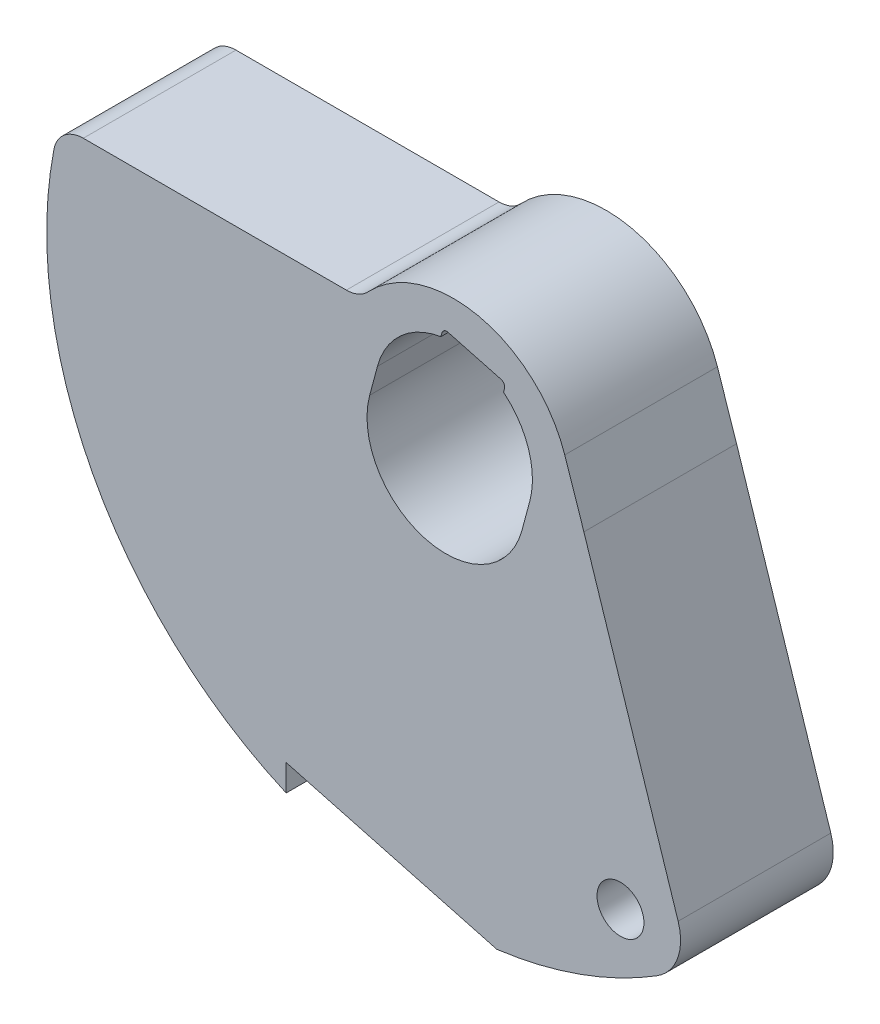
ISO-10303-21;
HEADER;
FILE_DESCRIPTION(('STEP AP214'),'2;1');
FILE_NAME('part.step','',(''),(''),'','','');
FILE_SCHEMA(('AUTOMOTIVE_DESIGN { 1 0 10303 214 1 1 1 1 }'));
ENDSEC;
DATA;
#1=APPLICATION_CONTEXT('core data for automotive mechanical design processes');
#2=APPLICATION_PROTOCOL_DEFINITION('international standard','automotive_design',2000,#1);
#3=PRODUCT_CONTEXT('',#1,'mechanical');
#4=PRODUCT('Part','Part','',(#3));
#5=PRODUCT_RELATED_PRODUCT_CATEGORY('part','',(#4));
#6=PRODUCT_DEFINITION_FORMATION('','',#4);
#7=PRODUCT_DEFINITION_CONTEXT('part definition',#1,'design');
#8=PRODUCT_DEFINITION('design','',#6,#7);
#9=PRODUCT_DEFINITION_SHAPE('','',#8);
#10=(LENGTH_UNIT() NAMED_UNIT(*) SI_UNIT(.MILLI.,.METRE.));
#11=(NAMED_UNIT(*) PLANE_ANGLE_UNIT() SI_UNIT($,.RADIAN.));
#12=(NAMED_UNIT(*) SI_UNIT($,.STERADIAN.) SOLID_ANGLE_UNIT());
#13=UNCERTAINTY_MEASURE_WITH_UNIT(LENGTH_MEASURE(1.E-05),#10,'distance_accuracy_value','');
#14=(GEOMETRIC_REPRESENTATION_CONTEXT(3) GLOBAL_UNCERTAINTY_ASSIGNED_CONTEXT((#13)) GLOBAL_UNIT_ASSIGNED_CONTEXT((#10,
#11,#12)) REPRESENTATION_CONTEXT('',''));
#15=CARTESIAN_POINT('',(0.,0.,0.));
#16=DIRECTION('',(0.,0.,1.));
#17=DIRECTION('',(1.,0.,0.));
#18=AXIS2_PLACEMENT_3D('',#15,#16,#17);
#19=CARTESIAN_POINT('',(0.,0.,-7.7724));
#20=DIRECTION('',(0.,0.,1.));
#21=DIRECTION('',(1.,0.,0.));
#22=AXIS2_PLACEMENT_3D('',#19,#20,#21);
#23=PLANE('',#22);
#24=DIRECTION('',(0.258819045102514,0.96592582628907,0.));
#25=VECTOR('',#24,1.);
#26=CARTESIAN_POINT('',(-1.59474353920326,0.427310243464251,-7.7724));
#27=LINE('',#26,#25);
#28=CARTESIAN_POINT('',(-0.253578298371034,5.43260706359561,-7.7724));
#29=VERTEX_POINT('',#28);
#30=CARTESIAN_POINT('',(-0.201054745135242,5.62862763286563,-7.7724));
#31=VERTEX_POINT('',#30);
#32=EDGE_CURVE('E330',#29,#31,#27,.T.);
#33=ORIENTED_EDGE('',*,*,#32,.F.);
#34=CARTESIAN_POINT('',(0.394440224736231,1.47207095926454,-7.7724));
#35=DIRECTION('',(0.,0.,1.));
#36=DIRECTION('',(1.,0.,0.));
#37=AXIS2_PLACEMENT_3D('',#34,#35,#36);
#38=CIRCLE('',#37,4.0132);
#39=CARTESIAN_POINT('',(-3.48201330132707,2.51076355106995,-7.7724));
#40=VERTEX_POINT('',#39);
#41=EDGE_CURVE('E221',#29,#40,#38,.T.);
#42=ORIENTED_EDGE('',*,*,#41,.T.);
#43=DIRECTION('',(0.258819045102514,0.96592582628907,0.));
#44=VECTOR('',#43,1.);
#45=CARTESIAN_POINT('',(-3.8764535260633,1.03869259180541,-7.7724));
#46=LINE('',#45,#44);
#47=CARTESIAN_POINT('',(-3.8764535260633,1.03869259180541,-7.7724));
#48=VERTEX_POINT('',#47);
#49=EDGE_CURVE('E351',#48,#40,#46,.T.);
#50=ORIENTED_EDGE('',*,*,#49,.F.);
#51=CARTESIAN_POINT('',(0.,0.,-7.7724));
#52=DIRECTION('',(0.,0.,1.));
#53=DIRECTION('',(1.,0.,0.));
#54=AXIS2_PLACEMENT_3D('',#51,#52,#53);
#55=CIRCLE('',#54,4.0132);
#56=CARTESIAN_POINT('',(3.8764535260633,-1.03869259180541,-7.7724));
#57=VERTEX_POINT('',#56);
#58=EDGE_CURVE('E349',#48,#57,#55,.T.);
#59=ORIENTED_EDGE('',*,*,#58,.T.);
#60=DIRECTION('',(-0.258819045102514,-0.96592582628907,0.));
#61=VECTOR('',#60,1.);
#62=CARTESIAN_POINT('',(3.8764535260633,-1.03869259180541,-7.7724));
#63=LINE('',#62,#61);
#64=CARTESIAN_POINT('',(4.27089375079953,0.433378367459132,-7.7724));
#65=VERTEX_POINT('',#64);
#66=EDGE_CURVE('E346',#65,#57,#63,.T.);
#67=ORIENTED_EDGE('',*,*,#66,.F.);
#68=CARTESIAN_POINT('',(0.394440224736231,1.47207095926454,-7.7724));
#69=DIRECTION('',(0.,0.,1.));
#70=DIRECTION('',(1.,0.,0.));
#71=AXIS2_PLACEMENT_3D('',#68,#69,#70);
#72=CIRCLE('',#71,4.0132);
#73=CARTESIAN_POINT('',(2.93590878003548,4.5779865766671,-7.7724));
#74=VERTEX_POINT('',#73);
#75=EDGE_CURVE('E343',#65,#74,#72,.T.);
#76=ORIENTED_EDGE('',*,*,#75,.T.);
#77=DIRECTION('',(0.258819045102513,0.96592582628907,0.));
#78=VECTOR('',#77,1.);
#79=CARTESIAN_POINT('',(1.59474353920326,-0.427310243464251,-7.7724));
#80=LINE('',#79,#78);
#81=CARTESIAN_POINT('',(2.98843233327127,4.77400714593713,-7.7724));
#82=VERTEX_POINT('',#81);
#83=EDGE_CURVE('E341',#74,#82,#80,.T.);
#84=ORIENTED_EDGE('',*,*,#83,.T.);
#85=CARTESIAN_POINT('',(2.74308717339385,4.83974718339317,-7.7724));
#86=DIRECTION('',(0.,0.,1.));
#87=DIRECTION('',(1.,0.,0.));
#88=AXIS2_PLACEMENT_3D('',#85,#86,#87);
#89=CIRCLE('',#88,0.254);
#90=CARTESIAN_POINT('',(2.80882721084989,5.0850923432706,-7.7724));
#91=VERTEX_POINT('',#90);
#92=EDGE_CURVE('E338',#91,#82,#89,.F.);
#93=ORIENTED_EDGE('',*,*,#92,.F.);
#94=DIRECTION('',(-0.96592582628907,0.258819045102514,0.));
#95=VECTOR('',#94,1.);
#96=CARTESIAN_POINT('',(1.45942883152406,5.44666254927881,-7.7724));
#97=LINE('',#96,#95);
#98=CARTESIAN_POINT('',(0.110030452198222,5.80823275528702,-7.7724));
#99=VERTEX_POINT('',#98);
#100=EDGE_CURVE('E336',#91,#99,#97,.T.);
#101=ORIENTED_EDGE('',*,*,#100,.T.);
#102=CARTESIAN_POINT('',(0.044290414742182,5.5628875954096,-7.7724));
#103=DIRECTION('',(0.,0.,1.));
#104=DIRECTION('',(1.,0.,0.));
#105=AXIS2_PLACEMENT_3D('',#102,#103,#104);
#106=CIRCLE('',#105,0.254);
#107=EDGE_CURVE('E333',#31,#99,#106,.F.);
#108=ORIENTED_EDGE('',*,*,#107,.F.);
#109=EDGE_LOOP('',(#33,#42,#50,#59,#67,#76,#84,#93,#101,#108));
#110=FACE_BOUND('',#109,.T.);
#111=CARTESIAN_POINT('',(8.89000000000001,-15.24,-7.7724));
#112=DIRECTION('',(0.,0.,1.));
#113=DIRECTION('',(1.,0.,0.));
#114=AXIS2_PLACEMENT_3D('',#111,#112,#113);
#115=CIRCLE('',#114,1.1938);
#116=CARTESIAN_POINT('',(10.0838,-15.24,-7.7724));
#117=VERTEX_POINT('',#116);
#118=EDGE_CURVE('E327',#117,#117,#115,.T.);
#119=ORIENTED_EDGE('',*,*,#118,.T.);
#120=EDGE_LOOP('',(#119));
#121=FACE_BOUND('',#120,.T.);
#122=DIRECTION('',(-0.309016994374945,0.951056516295155,0.));
#123=VECTOR('',#122,1.);
#124=CARTESIAN_POINT('',(6.4943201526941,2.11013253125259,-7.7724));
#125=LINE('',#124,#123);
#126=CARTESIAN_POINT('',(11.8264250960001,-14.3003990712514,-7.7724));
#127=VERTEX_POINT('',#126);
#128=CARTESIAN_POINT('',(7.02813733386458,0.467212180902899,-7.7724));
#129=VERTEX_POINT('',#128);
#130=EDGE_CURVE('E181',#127,#129,#125,.T.);
#131=ORIENTED_EDGE('',*,*,#130,.F.);
#132=CARTESIAN_POINT('',(9.41074154461045,-15.0853022369637,-7.7724));
#133=DIRECTION('',(0.,0.,1.));
#134=DIRECTION('',(1.,0.,0.));
#135=AXIS2_PLACEMENT_3D('',#132,#133,#134);
#136=CIRCLE('',#135,2.54);
#137=CARTESIAN_POINT('',(10.7551331938405,-17.2403454136728,-7.7724));
#138=VERTEX_POINT('',#137);
#139=EDGE_CURVE('E60',#127,#138,#136,.F.);
#140=ORIENTED_EDGE('',*,*,#139,.T.);
#141=CARTESIAN_POINT('',(0.,0.,-7.7724));
#142=DIRECTION('',(0.,0.,1.));
#143=DIRECTION('',(1.,0.,0.));
#144=AXIS2_PLACEMENT_3D('',#141,#142,#143);
#145=CIRCLE('',#144,20.32);
#146=CARTESIAN_POINT('',(2.59308441542165,-20.1538659620058,-7.7724));
#147=VERTEX_POINT('',#146);
#148=EDGE_CURVE('E198',#147,#138,#145,.T.);
#149=ORIENTED_EDGE('',*,*,#148,.F.);
#150=DIRECTION('',(0.96592582628907,-0.258819045102515,0.));
#151=VECTOR('',#150,1.);
#152=CARTESIAN_POINT('',(-4.86476277174687,-18.1555418309294,-7.7724));
#153=LINE('',#152,#151);
#154=CARTESIAN_POINT('',(-8.12799999999999,-17.2811600509078,-7.7724));
#155=VERTEX_POINT('',#154);
#156=EDGE_CURVE('E322',#155,#147,#153,.T.);
#157=ORIENTED_EDGE('',*,*,#156,.F.);
#158=DIRECTION('',(0.,-1.,0.));
#159=VECTOR('',#158,1.);
#160=CARTESIAN_POINT('',(-8.12799999999999,0.,-7.7724));
#161=LINE('',#160,#159);
#162=CARTESIAN_POINT('',(-8.12799999999999,-18.6235876243005,-7.7724));
#163=VERTEX_POINT('',#162);
#164=EDGE_CURVE('E320',#155,#163,#161,.T.);
#165=ORIENTED_EDGE('',*,*,#164,.T.);
#166=CARTESIAN_POINT('',(0.,0.,-7.7724));
#167=DIRECTION('',(0.,0.,1.));
#168=DIRECTION('',(1.,0.,0.));
#169=AXIS2_PLACEMENT_3D('',#166,#167,#168);
#170=CIRCLE('',#169,20.32);
#171=CARTESIAN_POINT('',(-19.953034117382,3.84432432432431,-7.7724));
#172=VERTEX_POINT('',#171);
#173=EDGE_CURVE('E317',#172,#163,#170,.T.);
#174=ORIENTED_EDGE('',*,*,#173,.F.);
#175=CARTESIAN_POINT('',(-18.4565565585783,3.55599999999999,-7.7724));
#176=DIRECTION('',(0.,0.,1.));
#177=DIRECTION('',(1.,0.,0.));
#178=AXIS2_PLACEMENT_3D('',#175,#176,#177);
#179=CIRCLE('',#178,1.524);
#180=CARTESIAN_POINT('',(-18.4565565585783,5.07999999999999,-7.7724));
#181=VERTEX_POINT('',#180);
#182=EDGE_CURVE('E312',#181,#172,#179,.T.);
#183=ORIENTED_EDGE('',*,*,#182,.F.);
#184=DIRECTION('',(-1.,0.,0.));
#185=VECTOR('',#184,1.);
#186=CARTESIAN_POINT('',(0.,5.07999999999999,-7.7724));
#187=LINE('',#186,#185);
#188=CARTESIAN_POINT('',(-5.06526245222852,5.07999999999999,-7.7724));
#189=VERTEX_POINT('',#188);
#190=EDGE_CURVE('E308',#189,#181,#187,.T.);
#191=ORIENTED_EDGE('',*,*,#190,.F.);
#192=CARTESIAN_POINT('',(-5.06526245222852,6.60399999999999,-7.7724));
#193=DIRECTION('',(0.,0.,1.));
#194=DIRECTION('',(1.,0.,0.));
#195=AXIS2_PLACEMENT_3D('',#192,#193,#194);
#196=CIRCLE('',#195,1.524);
#197=CARTESIAN_POINT('',(-3.954814450134,5.56021782222329,-7.7724));
#198=VERTEX_POINT('',#197);
#199=EDGE_CURVE('E306',#189,#198,#196,.T.);
#200=ORIENTED_EDGE('',*,*,#199,.T.);
#201=CARTESIAN_POINT('',(0.394440224736231,1.47207095926454,-7.7724));
#202=DIRECTION('',(0.,0.,1.));
#203=DIRECTION('',(1.,0.,0.));
#204=AXIS2_PLACEMENT_3D('',#201,#202,#203);
#205=CIRCLE('',#204,5.969);
#206=CARTESIAN_POINT('',(6.05309678714434,3.37169379254373,-7.7724));
#207=VERTEX_POINT('',#206);
#208=EDGE_CURVE('E196',#207,#198,#205,.T.);
#209=ORIENTED_EDGE('',*,*,#208,.F.);
#210=DIRECTION('',(0.318248087331075,-0.948007465640494,0.));
#211=VECTOR('',#210,1.);
#212=CARTESIAN_POINT('',(6.45727326224385,2.16772012833758,-7.7724));
#213=LINE('',#212,#211);
#214=EDGE_CURVE('E194',#207,#129,#213,.T.);
#215=ORIENTED_EDGE('',*,*,#214,.T.);
#216=EDGE_LOOP('',(#131,#140,#149,#157,#165,#174,#183,#191,#200,#209,#215));
#217=FACE_BOUND('',#216,.T.);
#218=ADVANCED_FACE('F38',(#110,#121,#217),#23,.F.);
#219=CARTESIAN_POINT('',(0.,0.,0.));
#220=DIRECTION('',(0.,0.,1.));
#221=DIRECTION('',(1.,0.,0.));
#222=AXIS2_PLACEMENT_3D('',#219,#220,#221);
#223=PLANE('',#222);
#224=CARTESIAN_POINT('',(8.89000000000001,-15.24,0.));
#225=DIRECTION('',(0.,0.,1.));
#226=DIRECTION('',(1.,0.,0.));
#227=AXIS2_PLACEMENT_3D('',#224,#225,#226);
#228=CIRCLE('',#227,1.1938);
#229=CARTESIAN_POINT('',(10.0838,-15.24,0.));
#230=VERTEX_POINT('',#229);
#231=EDGE_CURVE('E270',#230,#230,#228,.T.);
#232=ORIENTED_EDGE('',*,*,#231,.F.);
#233=EDGE_LOOP('',(#232));
#234=FACE_BOUND('',#233,.T.);
#235=DIRECTION('',(0.258819045102514,0.96592582628907,0.));
#236=VECTOR('',#235,1.);
#237=CARTESIAN_POINT('',(-1.59474353920326,0.427310243464251,0.));
#238=LINE('',#237,#236);
#239=CARTESIAN_POINT('',(-0.253578298371034,5.43260706359561,0.));
#240=VERTEX_POINT('',#239);
#241=CARTESIAN_POINT('',(-0.201054745135242,5.62862763286563,0.));
#242=VERTEX_POINT('',#241);
#243=EDGE_CURVE('E273',#240,#242,#238,.T.);
#244=ORIENTED_EDGE('',*,*,#243,.T.);
#245=CARTESIAN_POINT('',(0.044290414742182,5.5628875954096,0.));
#246=DIRECTION('',(0.,0.,1.));
#247=DIRECTION('',(1.,0.,0.));
#248=AXIS2_PLACEMENT_3D('',#245,#246,#247);
#249=CIRCLE('',#248,0.254);
#250=CARTESIAN_POINT('',(0.110030452198222,5.80823275528702,0.));
#251=VERTEX_POINT('',#250);
#252=EDGE_CURVE('E281',#242,#251,#249,.F.);
#253=ORIENTED_EDGE('',*,*,#252,.T.);
#254=DIRECTION('',(-0.96592582628907,0.258819045102514,0.));
#255=VECTOR('',#254,1.);
#256=CARTESIAN_POINT('',(1.45942883152406,5.44666254927881,0.));
#257=LINE('',#256,#255);
#258=CARTESIAN_POINT('',(2.80882721084989,5.0850923432706,0.));
#259=VERTEX_POINT('',#258);
#260=EDGE_CURVE('E284',#259,#251,#257,.T.);
#261=ORIENTED_EDGE('',*,*,#260,.F.);
#262=CARTESIAN_POINT('',(2.74308717339385,4.83974718339317,0.));
#263=DIRECTION('',(0.,0.,1.));
#264=DIRECTION('',(1.,0.,0.));
#265=AXIS2_PLACEMENT_3D('',#262,#263,#264);
#266=CIRCLE('',#265,0.254);
#267=CARTESIAN_POINT('',(2.98843233327127,4.77400714593713,0.));
#268=VERTEX_POINT('',#267);
#269=EDGE_CURVE('E287',#259,#268,#266,.F.);
#270=ORIENTED_EDGE('',*,*,#269,.T.);
#271=DIRECTION('',(0.258819045102513,0.96592582628907,0.));
#272=VECTOR('',#271,1.);
#273=CARTESIAN_POINT('',(1.59474353920326,-0.427310243464251,0.));
#274=LINE('',#273,#272);
#275=CARTESIAN_POINT('',(2.93590878003548,4.5779865766671,0.));
#276=VERTEX_POINT('',#275);
#277=EDGE_CURVE('E290',#276,#268,#274,.T.);
#278=ORIENTED_EDGE('',*,*,#277,.F.);
#279=CARTESIAN_POINT('',(0.394440224736231,1.47207095926454,0.));
#280=DIRECTION('',(0.,0.,1.));
#281=DIRECTION('',(1.,0.,0.));
#282=AXIS2_PLACEMENT_3D('',#279,#280,#281);
#283=CIRCLE('',#282,4.0132);
#284=CARTESIAN_POINT('',(4.27089375079953,0.433378367459132,0.));
#285=VERTEX_POINT('',#284);
#286=EDGE_CURVE('E293',#285,#276,#283,.T.);
#287=ORIENTED_EDGE('',*,*,#286,.F.);
#288=DIRECTION('',(-0.258819045102514,-0.96592582628907,0.));
#289=VECTOR('',#288,1.);
#290=CARTESIAN_POINT('',(3.8764535260633,-1.03869259180541,0.));
#291=LINE('',#290,#289);
#292=CARTESIAN_POINT('',(3.8764535260633,-1.03869259180541,0.));
#293=VERTEX_POINT('',#292);
#294=EDGE_CURVE('E296',#285,#293,#291,.T.);
#295=ORIENTED_EDGE('',*,*,#294,.T.);
#296=CARTESIAN_POINT('',(0.,0.,0.));
#297=DIRECTION('',(0.,0.,1.));
#298=DIRECTION('',(1.,0.,0.));
#299=AXIS2_PLACEMENT_3D('',#296,#297,#298);
#300=CIRCLE('',#299,4.0132);
#301=CARTESIAN_POINT('',(-3.8764535260633,1.03869259180541,0.));
#302=VERTEX_POINT('',#301);
#303=EDGE_CURVE('E299',#302,#293,#300,.T.);
#304=ORIENTED_EDGE('',*,*,#303,.F.);
#305=DIRECTION('',(0.258819045102514,0.96592582628907,0.));
#306=VECTOR('',#305,1.);
#307=CARTESIAN_POINT('',(-3.8764535260633,1.03869259180541,0.));
#308=LINE('',#307,#306);
#309=CARTESIAN_POINT('',(-3.48201330132707,2.51076355106995,0.));
#310=VERTEX_POINT('',#309);
#311=EDGE_CURVE('E301',#302,#310,#308,.T.);
#312=ORIENTED_EDGE('',*,*,#311,.T.);
#313=CARTESIAN_POINT('',(0.394440224736231,1.47207095926454,0.));
#314=DIRECTION('',(0.,0.,1.));
#315=DIRECTION('',(1.,0.,0.));
#316=AXIS2_PLACEMENT_3D('',#313,#314,#315);
#317=CIRCLE('',#316,4.0132);
#318=EDGE_CURVE('E236',#240,#310,#317,.T.);
#319=ORIENTED_EDGE('',*,*,#318,.F.);
#320=EDGE_LOOP('',(#244,#253,#261,#270,#278,#287,#295,#304,#312,#319));
#321=FACE_BOUND('',#320,.T.);
#322=CARTESIAN_POINT('',(0.,0.,0.));
#323=DIRECTION('',(0.,0.,1.));
#324=DIRECTION('',(1.,0.,0.));
#325=AXIS2_PLACEMENT_3D('',#322,#323,#324);
#326=CIRCLE('',#325,20.32);
#327=CARTESIAN_POINT('',(2.59308441542165,-20.1538659620058,0.));
#328=VERTEX_POINT('',#327);
#329=CARTESIAN_POINT('',(10.7551331938405,-17.2403454136728,0.));
#330=VERTEX_POINT('',#329);
#331=EDGE_CURVE('E275',#328,#330,#326,.T.);
#332=ORIENTED_EDGE('',*,*,#331,.T.);
#333=CARTESIAN_POINT('',(9.41074154461045,-15.0853022369637,0.));
#334=DIRECTION('',(0.,0.,1.));
#335=DIRECTION('',(1.,0.,0.));
#336=AXIS2_PLACEMENT_3D('',#333,#334,#335);
#337=CIRCLE('',#336,2.54);
#338=CARTESIAN_POINT('',(11.8264250960001,-14.3003990712514,0.));
#339=VERTEX_POINT('',#338);
#340=EDGE_CURVE('E11',#330,#339,#337,.T.);
#341=ORIENTED_EDGE('',*,*,#340,.T.);
#342=DIRECTION('',(-0.309016994374945,0.951056516295155,0.));
#343=VECTOR('',#342,1.);
#344=CARTESIAN_POINT('',(6.4943201526941,2.11013253125259,0.));
#345=LINE('',#344,#343);
#346=CARTESIAN_POINT('',(7.02813733386458,0.467212180902899,0.));
#347=VERTEX_POINT('',#346);
#348=EDGE_CURVE('E222',#339,#347,#345,.T.);
#349=ORIENTED_EDGE('',*,*,#348,.T.);
#350=DIRECTION('',(0.318248087331075,-0.948007465640494,0.));
#351=VECTOR('',#350,1.);
#352=CARTESIAN_POINT('',(6.45727326224385,2.16772012833758,0.));
#353=LINE('',#352,#351);
#354=CARTESIAN_POINT('',(6.05309678714434,3.37169379254373,0.));
#355=VERTEX_POINT('',#354);
#356=EDGE_CURVE('E202',#355,#347,#353,.T.);
#357=ORIENTED_EDGE('',*,*,#356,.F.);
#358=CARTESIAN_POINT('',(0.394440224736231,1.47207095926454,0.));
#359=DIRECTION('',(0.,0.,1.));
#360=DIRECTION('',(1.,0.,0.));
#361=AXIS2_PLACEMENT_3D('',#358,#359,#360);
#362=CIRCLE('',#361,5.969);
#363=CARTESIAN_POINT('',(-3.954814450134,5.56021782222329,0.));
#364=VERTEX_POINT('',#363);
#365=EDGE_CURVE('E260',#355,#364,#362,.T.);
#366=ORIENTED_EDGE('',*,*,#365,.T.);
#367=CARTESIAN_POINT('',(-5.06526245222852,6.60399999999999,0.));
#368=DIRECTION('',(0.,0.,1.));
#369=DIRECTION('',(1.,0.,0.));
#370=AXIS2_PLACEMENT_3D('',#367,#368,#369);
#371=CIRCLE('',#370,1.524);
#372=CARTESIAN_POINT('',(-5.06526245222852,5.07999999999999,0.));
#373=VERTEX_POINT('',#372);
#374=EDGE_CURVE('E190',#373,#364,#371,.T.);
#375=ORIENTED_EDGE('',*,*,#374,.F.);
#376=DIRECTION('',(-1.,0.,0.));
#377=VECTOR('',#376,1.);
#378=CARTESIAN_POINT('',(0.,5.07999999999999,0.));
#379=LINE('',#378,#377);
#380=CARTESIAN_POINT('',(-18.4565565585783,5.07999999999999,0.));
#381=VERTEX_POINT('',#380);
#382=EDGE_CURVE('E267',#373,#381,#379,.T.);
#383=ORIENTED_EDGE('',*,*,#382,.T.);
#384=CARTESIAN_POINT('',(-18.4565565585783,3.55599999999999,0.));
#385=DIRECTION('',(0.,0.,1.));
#386=DIRECTION('',(1.,0.,0.));
#387=AXIS2_PLACEMENT_3D('',#384,#385,#386);
#388=CIRCLE('',#387,1.524);
#389=CARTESIAN_POINT('',(-19.953034117382,3.84432432432431,0.));
#390=VERTEX_POINT('',#389);
#391=EDGE_CURVE('E356',#381,#390,#388,.T.);
#392=ORIENTED_EDGE('',*,*,#391,.T.);
#393=CARTESIAN_POINT('',(0.,0.,0.));
#394=DIRECTION('',(0.,0.,1.));
#395=DIRECTION('',(1.,0.,0.));
#396=AXIS2_PLACEMENT_3D('',#393,#394,#395);
#397=CIRCLE('',#396,20.32);
#398=CARTESIAN_POINT('',(-8.12799999999999,-18.6235876243005,0.));
#399=VERTEX_POINT('',#398);
#400=EDGE_CURVE('E359',#390,#399,#397,.T.);
#401=ORIENTED_EDGE('',*,*,#400,.T.);
#402=DIRECTION('',(0.,-1.,0.));
#403=VECTOR('',#402,1.);
#404=CARTESIAN_POINT('',(-8.12799999999999,0.,0.));
#405=LINE('',#404,#403);
#406=CARTESIAN_POINT('',(-8.12799999999999,-17.2811600509078,0.));
#407=VERTEX_POINT('',#406);
#408=EDGE_CURVE('E362',#407,#399,#405,.T.);
#409=ORIENTED_EDGE('',*,*,#408,.F.);
#410=DIRECTION('',(0.96592582628907,-0.258819045102515,0.));
#411=VECTOR('',#410,1.);
#412=CARTESIAN_POINT('',(-4.86476277174687,-18.1555418309294,0.));
#413=LINE('',#412,#411);
#414=EDGE_CURVE('E365',#407,#328,#413,.T.);
#415=ORIENTED_EDGE('',*,*,#414,.T.);
#416=EDGE_LOOP('',(#332,#341,#349,#357,#366,#375,#383,#392,#401,#409,#415));
#417=FACE_BOUND('',#416,.T.);
#418=ADVANCED_FACE('F269',(#234,#321,#417),#223,.T.);
#419=CARTESIAN_POINT('',(-1.59474353920326,0.427310243464251,-7.7724));
#420=DIRECTION('',(0.96592582628907,-0.258819045102514,0.));
#421=DIRECTION('',(0.258819045102514,0.96592582628907,0.));
#422=AXIS2_PLACEMENT_3D('',#419,#420,#421);
#423=PLANE('',#422);
#424=ORIENTED_EDGE('',*,*,#243,.F.);
#425=DIRECTION('',(0.,0.,1.));
#426=VECTOR('',#425,1.);
#427=CARTESIAN_POINT('',(-0.253578298371034,5.43260706359561,-7.7724));
#428=LINE('',#427,#426);
#429=EDGE_CURVE('E224',#29,#240,#428,.T.);
#430=ORIENTED_EDGE('',*,*,#429,.F.);
#431=ORIENTED_EDGE('',*,*,#32,.T.);
#432=DIRECTION('',(0.,0.,1.));
#433=VECTOR('',#432,1.);
#434=CARTESIAN_POINT('',(-0.201054745135242,5.62862763286563,-7.7724));
#435=LINE('',#434,#433);
#436=EDGE_CURVE('E253',#31,#242,#435,.T.);
#437=ORIENTED_EDGE('',*,*,#436,.T.);
#438=EDGE_LOOP('',(#424,#430,#431,#437));
#439=FACE_BOUND('',#438,.T.);
#440=ADVANCED_FACE('F383',(#439),#423,.T.);
#441=CARTESIAN_POINT('',(0.394440224736231,1.47207095926454,-7.7724));
#442=DIRECTION('',(0.,0.,1.));
#443=DIRECTION('',(1.,0.,0.));
#444=AXIS2_PLACEMENT_3D('',#441,#442,#443);
#445=CYLINDRICAL_SURFACE('',#444,4.0132);
#446=ORIENTED_EDGE('',*,*,#318,.T.);
#447=DIRECTION('',(0.,0.,1.));
#448=VECTOR('',#447,1.);
#449=CARTESIAN_POINT('',(-3.48201330132707,2.51076355106995,-7.7724));
#450=LINE('',#449,#448);
#451=EDGE_CURVE('E227',#40,#310,#450,.T.);
#452=ORIENTED_EDGE('',*,*,#451,.F.);
#453=ORIENTED_EDGE('',*,*,#41,.F.);
#454=ORIENTED_EDGE('',*,*,#429,.T.);
#455=EDGE_LOOP('',(#446,#452,#453,#454));
#456=FACE_BOUND('',#455,.T.);
#457=ADVANCED_FACE('F389',(#456),#445,.F.);
#458=CARTESIAN_POINT('',(-3.8764535260633,1.03869259180541,-7.7724));
#459=DIRECTION('',(0.96592582628907,-0.258819045102514,0.));
#460=DIRECTION('',(0.258819045102514,0.96592582628907,0.));
#461=AXIS2_PLACEMENT_3D('',#458,#459,#460);
#462=PLANE('',#461);
#463=ORIENTED_EDGE('',*,*,#311,.F.);
#464=DIRECTION('',(0.,0.,1.));
#465=VECTOR('',#464,1.);
#466=CARTESIAN_POINT('',(-3.8764535260633,1.03869259180541,-7.7724));
#467=LINE('',#466,#465);
#468=EDGE_CURVE('E233',#48,#302,#467,.T.);
#469=ORIENTED_EDGE('',*,*,#468,.F.);
#470=ORIENTED_EDGE('',*,*,#49,.T.);
#471=ORIENTED_EDGE('',*,*,#451,.T.);
#472=EDGE_LOOP('',(#463,#469,#470,#471));
#473=FACE_BOUND('',#472,.T.);
#474=ADVANCED_FACE('F392',(#473),#462,.T.);
#475=CARTESIAN_POINT('',(0.,0.,-7.7724));
#476=DIRECTION('',(0.,0.,1.));
#477=DIRECTION('',(1.,0.,0.));
#478=AXIS2_PLACEMENT_3D('',#475,#476,#477);
#479=CYLINDRICAL_SURFACE('',#478,4.0132);
#480=ORIENTED_EDGE('',*,*,#303,.T.);
#481=DIRECTION('',(0.,0.,1.));
#482=VECTOR('',#481,1.);
#483=CARTESIAN_POINT('',(3.8764535260633,-1.03869259180541,-7.7724));
#484=LINE('',#483,#482);
#485=EDGE_CURVE('E240',#57,#293,#484,.T.);
#486=ORIENTED_EDGE('',*,*,#485,.F.);
#487=ORIENTED_EDGE('',*,*,#58,.F.);
#488=ORIENTED_EDGE('',*,*,#468,.T.);
#489=EDGE_LOOP('',(#480,#486,#487,#488));
#490=FACE_BOUND('',#489,.T.);
#491=ADVANCED_FACE('F395',(#490),#479,.F.);
#492=CARTESIAN_POINT('',(3.8764535260633,-1.03869259180541,-7.7724));
#493=DIRECTION('',(-0.96592582628907,0.258819045102514,0.));
#494=DIRECTION('',(-0.258819045102514,-0.96592582628907,0.));
#495=AXIS2_PLACEMENT_3D('',#492,#493,#494);
#496=PLANE('',#495);
#497=ORIENTED_EDGE('',*,*,#294,.F.);
#498=DIRECTION('',(0.,0.,1.));
#499=VECTOR('',#498,1.);
#500=CARTESIAN_POINT('',(4.27089375079953,0.433378367459132,-7.7724));
#501=LINE('',#500,#499);
#502=EDGE_CURVE('E242',#65,#285,#501,.T.);
#503=ORIENTED_EDGE('',*,*,#502,.F.);
#504=ORIENTED_EDGE('',*,*,#66,.T.);
#505=ORIENTED_EDGE('',*,*,#485,.T.);
#506=EDGE_LOOP('',(#497,#503,#504,#505));
#507=FACE_BOUND('',#506,.T.);
#508=ADVANCED_FACE('F399',(#507),#496,.T.);
#509=CARTESIAN_POINT('',(0.394440224736231,1.47207095926454,-7.7724));
#510=DIRECTION('',(0.,0.,1.));
#511=DIRECTION('',(1.,0.,0.));
#512=AXIS2_PLACEMENT_3D('',#509,#510,#511);
#513=CYLINDRICAL_SURFACE('',#512,4.0132);
#514=ORIENTED_EDGE('',*,*,#286,.T.);
#515=DIRECTION('',(0.,0.,1.));
#516=VECTOR('',#515,1.);
#517=CARTESIAN_POINT('',(2.93590878003548,4.5779865766671,-7.7724));
#518=LINE('',#517,#516);
#519=EDGE_CURVE('E244',#74,#276,#518,.T.);
#520=ORIENTED_EDGE('',*,*,#519,.F.);
#521=ORIENTED_EDGE('',*,*,#75,.F.);
#522=ORIENTED_EDGE('',*,*,#502,.T.);
#523=EDGE_LOOP('',(#514,#520,#521,#522));
#524=FACE_BOUND('',#523,.T.);
#525=ADVANCED_FACE('F403',(#524),#513,.F.);
#526=CARTESIAN_POINT('',(1.59474353920326,-0.427310243464251,-7.7724));
#527=DIRECTION('',(0.96592582628907,-0.258819045102513,0.));
#528=DIRECTION('',(0.258819045102513,0.96592582628907,0.));
#529=AXIS2_PLACEMENT_3D('',#526,#527,#528);
#530=PLANE('',#529);
#531=ORIENTED_EDGE('',*,*,#277,.T.);
#532=DIRECTION('',(0.,0.,1.));
#533=VECTOR('',#532,1.);
#534=CARTESIAN_POINT('',(2.98843233327127,4.77400714593713,-7.7724));
#535=LINE('',#534,#533);
#536=EDGE_CURVE('E247',#82,#268,#535,.T.);
#537=ORIENTED_EDGE('',*,*,#536,.F.);
#538=ORIENTED_EDGE('',*,*,#83,.F.);
#539=ORIENTED_EDGE('',*,*,#519,.T.);
#540=EDGE_LOOP('',(#531,#537,#538,#539));
#541=FACE_BOUND('',#540,.T.);
#542=ADVANCED_FACE('F407',(#541),#530,.F.);
#543=CARTESIAN_POINT('',(2.74308717339385,4.83974718339317,-7.7724));
#544=DIRECTION('',(0.,0.,1.));
#545=DIRECTION('',(1.,0.,0.));
#546=AXIS2_PLACEMENT_3D('',#543,#544,#545);
#547=CYLINDRICAL_SURFACE('',#546,0.254);
#548=ORIENTED_EDGE('',*,*,#269,.F.);
#549=DIRECTION('',(0.,0.,1.));
#550=VECTOR('',#549,1.);
#551=CARTESIAN_POINT('',(2.80882721084989,5.0850923432706,-7.7724));
#552=LINE('',#551,#550);
#553=EDGE_CURVE('E249',#91,#259,#552,.T.);
#554=ORIENTED_EDGE('',*,*,#553,.F.);
#555=ORIENTED_EDGE('',*,*,#92,.T.);
#556=ORIENTED_EDGE('',*,*,#536,.T.);
#557=EDGE_LOOP('',(#548,#554,#555,#556));
#558=FACE_BOUND('',#557,.T.);
#559=ADVANCED_FACE('F411',(#558),#547,.F.);
#560=CARTESIAN_POINT('',(1.45942883152406,5.44666254927881,-7.7724));
#561=DIRECTION('',(0.258819045102514,0.96592582628907,0.));
#562=DIRECTION('',(-0.96592582628907,0.258819045102514,0.));
#563=AXIS2_PLACEMENT_3D('',#560,#561,#562);
#564=PLANE('',#563);
#565=ORIENTED_EDGE('',*,*,#260,.T.);
#566=DIRECTION('',(0.,0.,1.));
#567=VECTOR('',#566,1.);
#568=CARTESIAN_POINT('',(0.110030452198222,5.80823275528702,-7.7724));
#569=LINE('',#568,#567);
#570=EDGE_CURVE('E251',#99,#251,#569,.T.);
#571=ORIENTED_EDGE('',*,*,#570,.F.);
#572=ORIENTED_EDGE('',*,*,#100,.F.);
#573=ORIENTED_EDGE('',*,*,#553,.T.);
#574=EDGE_LOOP('',(#565,#571,#572,#573));
#575=FACE_BOUND('',#574,.T.);
#576=ADVANCED_FACE('F415',(#575),#564,.F.);
#577=CARTESIAN_POINT('',(-5.06526245222852,6.60399999999999,-7.7724));
#578=DIRECTION('',(0.,0.,1.));
#579=DIRECTION('',(1.,0.,0.));
#580=AXIS2_PLACEMENT_3D('',#577,#578,#579);
#581=CYLINDRICAL_SURFACE('',#580,1.524);
#582=ORIENTED_EDGE('',*,*,#374,.T.);
#583=DIRECTION('',(0.,0.,1.));
#584=VECTOR('',#583,1.);
#585=CARTESIAN_POINT('',(-3.954814450134,5.56021782222329,-7.7724));
#586=LINE('',#585,#584);
#587=EDGE_CURVE('E206',#198,#364,#586,.T.);
#588=ORIENTED_EDGE('',*,*,#587,.F.);
#589=ORIENTED_EDGE('',*,*,#199,.F.);
#590=DIRECTION('',(0.,0.,1.));
#591=VECTOR('',#590,1.);
#592=CARTESIAN_POINT('',(-5.06526245222852,5.07999999999999,-7.7724));
#593=LINE('',#592,#591);
#594=EDGE_CURVE('E219',#189,#373,#593,.T.);
#595=ORIENTED_EDGE('',*,*,#594,.T.);
#596=EDGE_LOOP('',(#582,#588,#589,#595));
#597=FACE_BOUND('',#596,.T.);
#598=ADVANCED_FACE('F264',(#597),#581,.F.);
#599=CARTESIAN_POINT('',(0.394440224736231,1.47207095926454,-7.7724));
#600=DIRECTION('',(0.,0.,1.));
#601=DIRECTION('',(1.,0.,0.));
#602=AXIS2_PLACEMENT_3D('',#599,#600,#601);
#603=CYLINDRICAL_SURFACE('',#602,5.969);
#604=ORIENTED_EDGE('',*,*,#365,.F.);
#605=DIRECTION('',(0.,0.,1.));
#606=VECTOR('',#605,1.);
#607=CARTESIAN_POINT('',(6.05309678714434,3.37169379254373,-7.7724));
#608=LINE('',#607,#606);
#609=EDGE_CURVE('E203',#207,#355,#608,.T.);
#610=ORIENTED_EDGE('',*,*,#609,.F.);
#611=ORIENTED_EDGE('',*,*,#208,.T.);
#612=ORIENTED_EDGE('',*,*,#587,.T.);
#613=EDGE_LOOP('',(#604,#610,#611,#612));
#614=FACE_BOUND('',#613,.T.);
#615=ADVANCED_FACE('F258',(#614),#603,.T.);
#616=CARTESIAN_POINT('',(6.45727326224385,2.16772012833758,-7.7724));
#617=DIRECTION('',(-0.948007465640494,-0.318248087331075,0.));
#618=DIRECTION('',(0.318248087331075,-0.948007465640494,0.));
#619=AXIS2_PLACEMENT_3D('',#616,#617,#618);
#620=PLANE('',#619);
#621=ORIENTED_EDGE('',*,*,#356,.T.);
#622=DIRECTION('',(0.,0.,1.));
#623=VECTOR('',#622,1.);
#624=CARTESIAN_POINT('',(7.02813733386458,0.467212180902899,-7.7724));
#625=LINE('',#624,#623);
#626=EDGE_CURVE('E186',#129,#347,#625,.T.);
#627=ORIENTED_EDGE('',*,*,#626,.F.);
#628=ORIENTED_EDGE('',*,*,#214,.F.);
#629=ORIENTED_EDGE('',*,*,#609,.T.);
#630=EDGE_LOOP('',(#621,#627,#628,#629));
#631=FACE_BOUND('',#630,.T.);
#632=ADVANCED_FACE('F200',(#631),#620,.F.);
#633=CARTESIAN_POINT('',(0.,0.,-7.7724));
#634=DIRECTION('',(0.,0.,1.));
#635=DIRECTION('',(1.,0.,0.));
#636=AXIS2_PLACEMENT_3D('',#633,#634,#635);
#637=CYLINDRICAL_SURFACE('',#636,20.32);
#638=ORIENTED_EDGE('',*,*,#148,.T.);
#639=DIRECTION('',(0.,0.,1.));
#640=VECTOR('',#639,1.);
#641=CARTESIAN_POINT('',(10.7551331938405,-17.2403454136728,-7.7724));
#642=LINE('',#641,#640);
#643=EDGE_CURVE('E46',#138,#330,#642,.T.);
#644=ORIENTED_EDGE('',*,*,#643,.T.);
#645=ORIENTED_EDGE('',*,*,#331,.F.);
#646=DIRECTION('',(0.,0.,1.));
#647=VECTOR('',#646,1.);
#648=CARTESIAN_POINT('',(2.59308441542165,-20.1538659620058,-7.7724));
#649=LINE('',#648,#647);
#650=EDGE_CURVE('E204',#147,#328,#649,.T.);
#651=ORIENTED_EDGE('',*,*,#650,.F.);
#652=EDGE_LOOP('',(#638,#644,#645,#651));
#653=FACE_BOUND('',#652,.T.);
#654=ADVANCED_FACE('F436',(#653),#637,.T.);
#655=CARTESIAN_POINT('',(-4.86476277174687,-18.1555418309294,-7.7724));
#656=DIRECTION('',(-0.258819045102515,-0.96592582628907,0.));
#657=DIRECTION('',(0.96592582628907,-0.258819045102515,0.));
#658=AXIS2_PLACEMENT_3D('',#655,#656,#657);
#659=PLANE('',#658);
#660=ORIENTED_EDGE('',*,*,#414,.F.);
#661=DIRECTION('',(0.,0.,1.));
#662=VECTOR('',#661,1.);
#663=CARTESIAN_POINT('',(-8.12799999999999,-17.2811600509078,-7.7724));
#664=LINE('',#663,#662);
#665=EDGE_CURVE('E208',#155,#407,#664,.T.);
#666=ORIENTED_EDGE('',*,*,#665,.F.);
#667=ORIENTED_EDGE('',*,*,#156,.T.);
#668=ORIENTED_EDGE('',*,*,#650,.T.);
#669=EDGE_LOOP('',(#660,#666,#667,#668));
#670=FACE_BOUND('',#669,.T.);
#671=ADVANCED_FACE('F439',(#670),#659,.T.);
#672=CARTESIAN_POINT('',(-8.12799999999999,0.,-7.7724));
#673=DIRECTION('',(-1.,0.,0.));
#674=DIRECTION('',(0.,0.,1.));
#675=AXIS2_PLACEMENT_3D('',#672,#673,#674);
#676=PLANE('',#675);
#677=ORIENTED_EDGE('',*,*,#408,.T.);
#678=DIRECTION('',(0.,0.,1.));
#679=VECTOR('',#678,1.);
#680=CARTESIAN_POINT('',(-8.12799999999999,-18.6235876243005,-7.7724));
#681=LINE('',#680,#679);
#682=EDGE_CURVE('E213',#163,#399,#681,.T.);
#683=ORIENTED_EDGE('',*,*,#682,.F.);
#684=ORIENTED_EDGE('',*,*,#164,.F.);
#685=ORIENTED_EDGE('',*,*,#665,.T.);
#686=EDGE_LOOP('',(#677,#683,#684,#685));
#687=FACE_BOUND('',#686,.T.);
#688=ADVANCED_FACE('F442',(#687),#676,.F.);
#689=CARTESIAN_POINT('',(0.,0.,-7.7724));
#690=DIRECTION('',(0.,0.,1.));
#691=DIRECTION('',(1.,0.,0.));
#692=AXIS2_PLACEMENT_3D('',#689,#690,#691);
#693=CYLINDRICAL_SURFACE('',#692,20.32);
#694=ORIENTED_EDGE('',*,*,#400,.F.);
#695=DIRECTION('',(0.,0.,1.));
#696=VECTOR('',#695,1.);
#697=CARTESIAN_POINT('',(-19.953034117382,3.84432432432431,-7.7724));
#698=LINE('',#697,#696);
#699=EDGE_CURVE('E215',#172,#390,#698,.T.);
#700=ORIENTED_EDGE('',*,*,#699,.F.);
#701=ORIENTED_EDGE('',*,*,#173,.T.);
#702=ORIENTED_EDGE('',*,*,#682,.T.);
#703=EDGE_LOOP('',(#694,#700,#701,#702));
#704=FACE_BOUND('',#703,.T.);
#705=ADVANCED_FACE('F446',(#704),#693,.T.);
#706=CARTESIAN_POINT('',(-18.4565565585783,3.55599999999999,-7.7724));
#707=DIRECTION('',(0.,0.,1.));
#708=DIRECTION('',(1.,0.,0.));
#709=AXIS2_PLACEMENT_3D('',#706,#707,#708);
#710=CYLINDRICAL_SURFACE('',#709,1.524);
#711=ORIENTED_EDGE('',*,*,#391,.F.);
#712=DIRECTION('',(0.,0.,1.));
#713=VECTOR('',#712,1.);
#714=CARTESIAN_POINT('',(-18.4565565585783,5.07999999999999,-7.7724));
#715=LINE('',#714,#713);
#716=EDGE_CURVE('E217',#181,#381,#715,.T.);
#717=ORIENTED_EDGE('',*,*,#716,.F.);
#718=ORIENTED_EDGE('',*,*,#182,.T.);
#719=ORIENTED_EDGE('',*,*,#699,.T.);
#720=EDGE_LOOP('',(#711,#717,#718,#719));
#721=FACE_BOUND('',#720,.T.);
#722=ADVANCED_FACE('F430',(#721),#710,.T.);
#723=CARTESIAN_POINT('',(8.89000000000001,-15.24,-7.7724));
#724=DIRECTION('',(0.,0.,1.));
#725=DIRECTION('',(1.,0.,0.));
#726=AXIS2_PLACEMENT_3D('',#723,#724,#725);
#727=CYLINDRICAL_SURFACE('',#726,1.1938);
#728=ORIENTED_EDGE('',*,*,#118,.F.);
#729=EDGE_LOOP('',(#728));
#730=FACE_BOUND('',#729,.T.);
#731=ORIENTED_EDGE('',*,*,#231,.T.);
#732=EDGE_LOOP('',(#731));
#733=FACE_BOUND('',#732,.T.);
#734=ADVANCED_FACE('F427',(#730,#733),#727,.F.);
#735=CARTESIAN_POINT('',(0.,5.07999999999999,-7.7724));
#736=DIRECTION('',(0.,1.,0.));
#737=DIRECTION('',(-1.,0.,0.));
#738=AXIS2_PLACEMENT_3D('',#735,#736,#737);
#739=PLANE('',#738);
#740=ORIENTED_EDGE('',*,*,#382,.F.);
#741=ORIENTED_EDGE('',*,*,#594,.F.);
#742=ORIENTED_EDGE('',*,*,#190,.T.);
#743=ORIENTED_EDGE('',*,*,#716,.T.);
#744=EDGE_LOOP('',(#740,#741,#742,#743));
#745=FACE_BOUND('',#744,.T.);
#746=ADVANCED_FACE('F422',(#745),#739,.T.);
#747=CARTESIAN_POINT('',(0.044290414742182,5.5628875954096,-7.7724));
#748=DIRECTION('',(0.,0.,1.));
#749=DIRECTION('',(1.,0.,0.));
#750=AXIS2_PLACEMENT_3D('',#747,#748,#749);
#751=CYLINDRICAL_SURFACE('',#750,0.254);
#752=ORIENTED_EDGE('',*,*,#252,.F.);
#753=ORIENTED_EDGE('',*,*,#436,.F.);
#754=ORIENTED_EDGE('',*,*,#107,.T.);
#755=ORIENTED_EDGE('',*,*,#570,.T.);
#756=EDGE_LOOP('',(#752,#753,#754,#755));
#757=FACE_BOUND('',#756,.T.);
#758=ADVANCED_FACE('F375',(#757),#751,.F.);
#759=CARTESIAN_POINT('',(7.02813733386458,0.467212180902899,58.9711758960451));
#760=DIRECTION('',(0.951056516295155,0.309016994374945,0.));
#761=DIRECTION('',(-0.309016994374945,0.951056516295155,0.));
#762=AXIS2_PLACEMENT_3D('',#759,#760,#761);
#763=PLANE('',#762);
#764=ORIENTED_EDGE('',*,*,#348,.F.);
#765=DIRECTION('',(0.,0.,1.));
#766=VECTOR('',#765,1.);
#767=CARTESIAN_POINT('',(11.8264250960001,-14.3003990712514,58.9711758960451));
#768=LINE('',#767,#766);
#769=EDGE_CURVE('E189',#339,#127,#768,.F.);
#770=ORIENTED_EDGE('',*,*,#769,.T.);
#771=ORIENTED_EDGE('',*,*,#130,.T.);
#772=ORIENTED_EDGE('',*,*,#626,.T.);
#773=EDGE_LOOP('',(#764,#770,#771,#772));
#774=FACE_BOUND('',#773,.T.);
#775=ADVANCED_FACE('F184',(#774),#763,.T.);
#776=CARTESIAN_POINT('',(9.41074154461045,-15.0853022369637,-7.7724));
#777=DIRECTION('',(0.,0.,1.));
#778=DIRECTION('',(1.,0.,0.));
#779=AXIS2_PLACEMENT_3D('',#776,#777,#778);
#780=CYLINDRICAL_SURFACE('',#779,2.54);
#781=ORIENTED_EDGE('',*,*,#340,.F.);
#782=ORIENTED_EDGE('',*,*,#643,.F.);
#783=ORIENTED_EDGE('',*,*,#139,.F.);
#784=ORIENTED_EDGE('',*,*,#769,.F.);
#785=EDGE_LOOP('',(#781,#782,#783,#784));
#786=FACE_BOUND('',#785,.T.);
#787=ADVANCED_FACE('F40',(#786),#780,.T.);
#788=CLOSED_SHELL('',(#218,#418,#440,#457,#474,#491,#508,#525,#542,#559,#576,#598,#615,#632,
#654,#671,#688,#705,#722,#734,#746,#758,#775,#787));
#789=MANIFOLD_SOLID_BREP('B2',#788);
#790=ADVANCED_BREP_SHAPE_REPRESENTATION('',(#18,#789),#14);
#791=SHAPE_DEFINITION_REPRESENTATION(#9,#790);
ENDSEC;
END-ISO-10303-21;
